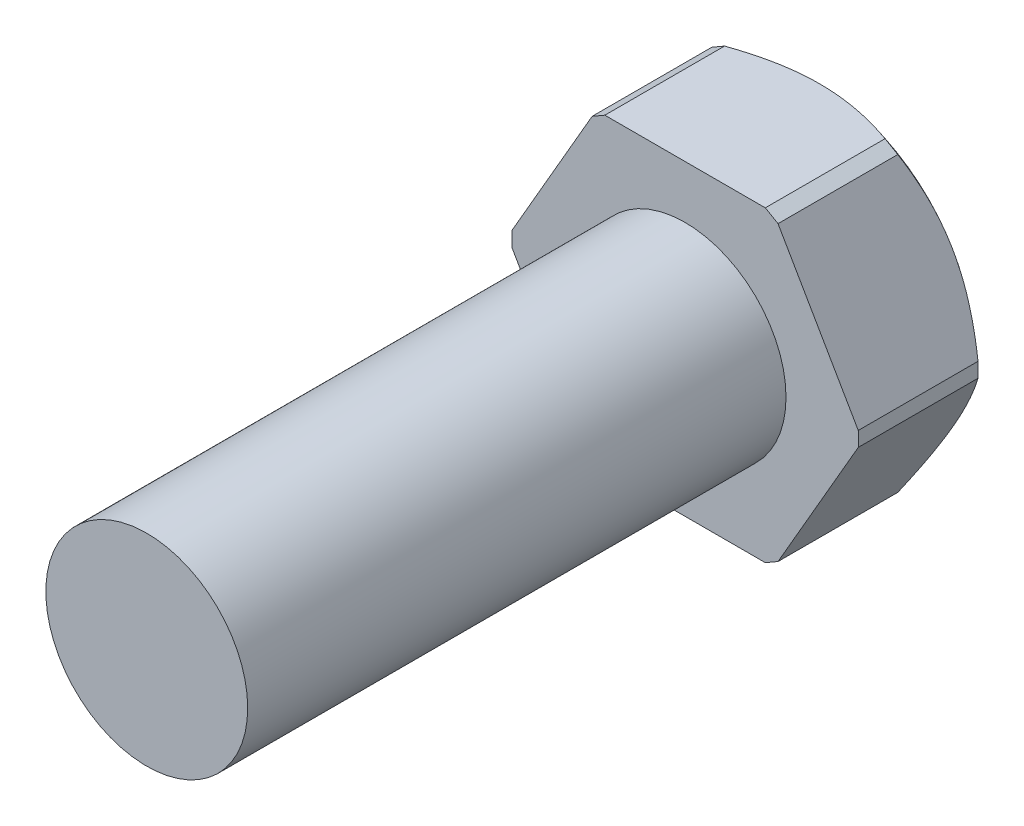
ISO-10303-21;
HEADER;
FILE_DESCRIPTION(('STEP AP214'),'2;1');
FILE_NAME('part.step','',(''),(''),'','','');
FILE_SCHEMA(('AUTOMOTIVE_DESIGN { 1 0 10303 214 1 1 1 1 }'));
ENDSEC;
DATA;
#1=APPLICATION_CONTEXT('core data for automotive mechanical design processes');
#2=APPLICATION_PROTOCOL_DEFINITION('international standard','automotive_design',2000,#1);
#3=PRODUCT_CONTEXT('',#1,'mechanical');
#4=PRODUCT('Part','Part','',(#3));
#5=PRODUCT_RELATED_PRODUCT_CATEGORY('part','',(#4));
#6=PRODUCT_DEFINITION_FORMATION('','',#4);
#7=PRODUCT_DEFINITION_CONTEXT('part definition',#1,'design');
#8=PRODUCT_DEFINITION('design','',#6,#7);
#9=PRODUCT_DEFINITION_SHAPE('','',#8);
#10=(LENGTH_UNIT() NAMED_UNIT(*) SI_UNIT(.MILLI.,.METRE.));
#11=(NAMED_UNIT(*) PLANE_ANGLE_UNIT() SI_UNIT($,.RADIAN.));
#12=(NAMED_UNIT(*) SI_UNIT($,.STERADIAN.) SOLID_ANGLE_UNIT());
#13=UNCERTAINTY_MEASURE_WITH_UNIT(LENGTH_MEASURE(1.E-05),#10,'distance_accuracy_value','');
#14=(GEOMETRIC_REPRESENTATION_CONTEXT(3) GLOBAL_UNCERTAINTY_ASSIGNED_CONTEXT((#13)) GLOBAL_UNIT_ASSIGNED_CONTEXT((#10,
#11,#12)) REPRESENTATION_CONTEXT('',''));
#15=CARTESIAN_POINT('',(0.,0.,0.));
#16=DIRECTION('',(0.,0.,1.));
#17=DIRECTION('',(1.,0.,0.));
#18=AXIS2_PLACEMENT_3D('',#15,#16,#17);
#19=CARTESIAN_POINT('',(4.18578945162487,-7.24999999999994,6.35));
#20=DIRECTION('',(-0.866025403784442,0.499999999999995,0.));
#21=DIRECTION('',(-0.499999999999995,-0.866025403784442,0.));
#22=AXIS2_PLACEMENT_3D('',#19,#20,#21);
#23=PLANE('',#22);
#24=DIRECTION('',(0.499999999999995,0.866025403784442,0.));
#25=VECTOR('',#24,1.);
#26=CARTESIAN_POINT('',(4.18578945162487,-7.24999999999994,6.35));
#27=LINE('',#26,#25);
#28=CARTESIAN_POINT('',(4.38578945162487,-6.90358983848616,6.35));
#29=VERTEX_POINT('',#28);
#30=CARTESIAN_POINT('',(8.17157890324957,-0.346410161513772,6.35));
#31=VERTEX_POINT('',#30);
#32=EDGE_CURVE('E265',#29,#31,#27,.T.);
#33=ORIENTED_EDGE('',*,*,#32,.F.);
#34=DIRECTION('',(0.,0.,-1.));
#35=VECTOR('',#34,1.);
#36=CARTESIAN_POINT('',(4.38578945162487,-6.90358983848616,6.35));
#37=LINE('',#36,#35);
#38=CARTESIAN_POINT('',(4.38578945162487,-6.90358983848616,0.699990018835444));
#39=VERTEX_POINT('',#38);
#40=EDGE_CURVE('E349',#29,#39,#37,.T.);
#41=ORIENTED_EDGE('',*,*,#40,.T.);
#42=CARTESIAN_POINT('',(8.3716943733034,0.000200000000000181,0.845257339780545));
#43=CARTESIAN_POINT('',(8.21794736422977,-0.266097631227295,0.729447113338614));
#44=CARTESIAN_POINT('',(8.06249149877793,-0.535355088524471,0.621816454666651));
#45=CARTESIAN_POINT('',(7.74782537875445,-1.08037279582571,0.427629359609718));
#46=CARTESIAN_POINT('',(7.58860502209093,-1.35615054316616,0.341138956178803));
#47=CARTESIAN_POINT('',(7.26857294470301,-1.91046236125387,0.195429584101643));
#48=CARTESIAN_POINT('',(7.10779134181242,-2.18894426638273,0.135955861824631));
#49=CARTESIAN_POINT('',(6.8651730026981,-2.60917155657672,0.0697386262103247));
#50=CARTESIAN_POINT('',(6.7840952919261,-2.7496022709952,0.0515014191885122));
#51=CARTESIAN_POINT('',(6.6215924413875,-3.03106546450283,0.0230431901224058));
#52=CARTESIAN_POINT('',(6.54016735003219,-3.17209785974117,0.0128210855588964));
#53=CARTESIAN_POINT('',(6.37601446521588,-3.45641899645203,0.000552368155458375));
#54=CARTESIAN_POINT('',(6.29328447830011,-3.59971153709965,-0.00137705293878134));
#55=CARTESIAN_POINT('',(6.1278848349123,-3.88619212300111,0.0033049604391076));
#56=CARTESIAN_POINT('',(6.04521517887639,-4.02938016749955,0.00991645605377523));
#57=CARTESIAN_POINT('',(5.88011192479759,-4.315347392059,0.0315258990519123));
#58=CARTESIAN_POINT('',(5.79767845736022,-4.45812634590459,0.0465278238628953));
#59=CARTESIAN_POINT('',(5.63327232170339,-4.74288612593828,0.0845646529897286));
#60=CARTESIAN_POINT('',(5.55129971667788,-4.88486684267124,0.107600632901399));
#61=CARTESIAN_POINT('',(5.30639050250552,-5.30906204485956,0.18801450070767));
#62=CARTESIAN_POINT('',(5.14436514369604,-5.58969819843215,0.256712062155177));
#63=CARTESIAN_POINT('',(4.82363026243174,-6.14522730854149,0.419269973294307));
#64=CARTESIAN_POINT('',(4.66491990157233,-6.42012171723759,0.513123875492929));
#65=CARTESIAN_POINT('',(4.45375692988558,-6.78586671287627,0.652811200701552));
#66=CARTESIAN_POINT('',(4.39980391337944,-6.87931607868651,0.689826685749797));
#67=CARTESIAN_POINT('',(4.29239695639809,-7.06535038526458,0.765981376798814));
#68=CARTESIAN_POINT('',(4.23894222460691,-7.15793669663187,0.805116114830897));
#69=CARTESIAN_POINT('',(4.18567398157103,-7.25019999999995,0.845257339780545));
#70=B_SPLINE_CURVE_WITH_KNOTS('',3,(#42,#43,#44,#45,#46,#47,#48,#49,#50,#51,#52,#53,#54,#55,#56,
#57,#58,#59,#60,#61,#62,#63,#64,#65,#66,#67,#68,#69),.UNSPECIFIED.,.F.,.F.,(4,2,2,2,2,2,2,2,2,2,
2,2,2,4),(0.,0.986085964652039,1.97521376105338,2.95481044041136,3.4441775332449,
3.93347852080068,4.42967200709298,4.92586904554469,5.42230150253419,5.91880044721531,
6.91121518526796,7.90337581327613,8.24559600631945,8.58712084857781),.UNSPECIFIED.);
#71=CARTESIAN_POINT('',(6.27868417743719,-3.62499999999996,0.));
#72=VERTEX_POINT('',#71);
#73=EDGE_CURVE('E177',#72,#39,#70,.T.);
#74=ORIENTED_EDGE('',*,*,#73,.F.);
#75=CARTESIAN_POINT('',(8.17157890323818,-0.346410161533495,0.699990018827494));
#76=VERTEX_POINT('',#75);
#77=EDGE_CURVE('E171',#76,#72,#70,.T.);
#78=ORIENTED_EDGE('',*,*,#77,.F.);
#79=DIRECTION('',(0.,0.,1.));
#80=VECTOR('',#79,1.);
#81=CARTESIAN_POINT('',(8.17157890324957,-0.346410161513772,6.35));
#82=LINE('',#81,#80);
#83=EDGE_CURVE('E51',#76,#31,#82,.T.);
#84=ORIENTED_EDGE('',*,*,#83,.T.);
#85=EDGE_LOOP('',(#33,#41,#74,#78,#84));
#86=FACE_BOUND('',#85,.T.);
#87=ADVANCED_FACE('F32',(#86),#23,.F.);
#88=CARTESIAN_POINT('',(8.37157890324957,0.,6.35));
#89=DIRECTION('',(-0.866025403784438,-0.500000000000001,0.));
#90=DIRECTION('',(0.500000000000001,-0.866025403784438,0.));
#91=AXIS2_PLACEMENT_3D('',#88,#89,#90);
#92=PLANE('',#91);
#93=DIRECTION('',(-0.500000000000001,0.866025403784438,0.));
#94=VECTOR('',#93,1.);
#95=CARTESIAN_POINT('',(8.37157890324957,0.,6.35));
#96=LINE('',#95,#94);
#97=CARTESIAN_POINT('',(8.17157890324956,0.346410161513784,6.35));
#98=VERTEX_POINT('',#97);
#99=CARTESIAN_POINT('',(4.38578945162477,6.90358983848623,6.35));
#100=VERTEX_POINT('',#99);
#101=EDGE_CURVE('E255',#98,#100,#96,.T.);
#102=ORIENTED_EDGE('',*,*,#101,.F.);
#103=DIRECTION('',(0.,0.,-1.));
#104=VECTOR('',#103,1.);
#105=CARTESIAN_POINT('',(8.17157890324956,0.346410161513784,6.35));
#106=LINE('',#105,#104);
#107=CARTESIAN_POINT('',(8.17157890324956,0.346410161531035,0.699990018835983));
#108=VERTEX_POINT('',#107);
#109=EDGE_CURVE('E257',#98,#108,#106,.T.);
#110=ORIENTED_EDGE('',*,*,#109,.T.);
#111=CARTESIAN_POINT('',(4.18567398157093,7.2502,0.845257339780545));
#112=CARTESIAN_POINT('',(4.33942099064457,6.98390236877271,0.729447113338614));
#113=CARTESIAN_POINT('',(4.49487685609641,6.71464491147553,0.621816454666651));
#114=CARTESIAN_POINT('',(4.80954297611989,6.16962720417429,0.427629359609714));
#115=CARTESIAN_POINT('',(4.96876333278341,5.89384945683384,0.341138956178796));
#116=CARTESIAN_POINT('',(5.28879541017133,5.33953763874614,0.195429584101633));
#117=CARTESIAN_POINT('',(5.44957701306192,5.06105573361728,0.135955861824619));
#118=CARTESIAN_POINT('',(5.69219535217625,4.64082844342329,0.0697386262103092));
#119=CARTESIAN_POINT('',(5.77327306294825,4.50039772900481,0.0515014191884955));
#120=CARTESIAN_POINT('',(5.93577591348685,4.21893453549718,0.0230431901223872));
#121=CARTESIAN_POINT('',(6.01720100484217,4.07790214025884,0.012821085558877));
#122=CARTESIAN_POINT('',(6.18135388965848,3.79358100354798,0.000552368155437234));
#123=CARTESIAN_POINT('',(6.26408387657425,3.65028846290037,-0.00137705293880349));
#124=CARTESIAN_POINT('',(6.42948351996206,3.3638078769989,0.00330496043908367));
#125=CARTESIAN_POINT('',(6.51215317599797,3.22061983250046,0.00991645605375058));
#126=CARTESIAN_POINT('',(6.67725643007677,2.93465260794102,0.031525899051886));
#127=CARTESIAN_POINT('',(6.75968989751414,2.79187365409542,0.0465278238628679));
#128=CARTESIAN_POINT('',(6.92409603317097,2.50711387406174,0.0845646529897001));
#129=CARTESIAN_POINT('',(7.00606863819648,2.36513315732878,0.10760063290137));
#130=CARTESIAN_POINT('',(7.25097785236885,1.94093795514046,0.18801450070764));
#131=CARTESIAN_POINT('',(7.41300321117833,1.66030180156787,0.256712062155146));
#132=CARTESIAN_POINT('',(7.73373809244264,1.10477269145853,0.419269973294274));
#133=CARTESIAN_POINT('',(7.89244845330205,0.829878282762435,0.513123875492894));
#134=CARTESIAN_POINT('',(8.10361142498881,0.464133287123737,0.652811200701523));
#135=CARTESIAN_POINT('',(8.15756444149496,0.370683921313491,0.689826685749774));
#136=CARTESIAN_POINT('',(8.26497139847633,0.184649614735391,0.765981376798802));
#137=CARTESIAN_POINT('',(8.31842613026751,0.0920633033680921,0.80511611483089));
#138=CARTESIAN_POINT('',(8.3716943733034,-0.00020000000000021,0.845257339780543));
#139=B_SPLINE_CURVE_WITH_KNOTS('',3,(#111,#112,#113,#114,#115,#116,#117,#118,#119,#120,#121,
#122,#123,#124,#125,#126,#127,#128,#129,#130,#131,#132,#133,#134,#135,#136,#137,#138),
.UNSPECIFIED.,.F.,.F.,(4,2,2,2,2,2,2,2,2,2,2,2,2,4),(0.,0.98608596465204,1.97521376105338,
2.95481044041137,3.4441775332449,3.93347852080068,4.42967200709298,4.92586904554469,
5.4223015025342,5.91880044721532,6.91121518526797,7.90337581327614,8.24559600631951,
8.58712084857791),.UNSPECIFIED.);
#140=CARTESIAN_POINT('',(6.27868417743717,3.625,0.));
#141=VERTEX_POINT('',#140);
#142=EDGE_CURVE('E174',#141,#108,#139,.T.);
#143=ORIENTED_EDGE('',*,*,#142,.F.);
#144=CARTESIAN_POINT('',(4.38578945161393,6.903589838505,0.699990018842994));
#145=VERTEX_POINT('',#144);
#146=EDGE_CURVE('E236',#145,#141,#139,.T.);
#147=ORIENTED_EDGE('',*,*,#146,.F.);
#148=DIRECTION('',(0.,0.,1.));
#149=VECTOR('',#148,1.);
#150=CARTESIAN_POINT('',(4.38578945162477,6.90358983848623,6.35));
#151=LINE('',#150,#149);
#152=EDGE_CURVE('E259',#145,#100,#151,.T.);
#153=ORIENTED_EDGE('',*,*,#152,.T.);
#154=EDGE_LOOP('',(#102,#110,#143,#147,#153));
#155=FACE_BOUND('',#154,.T.);
#156=ADVANCED_FACE('F242',(#155),#92,.F.);
#157=CARTESIAN_POINT('',(4.18578945162477,7.25,6.35));
#158=DIRECTION('',(0.,-1.,0.));
#159=DIRECTION('',(1.,0.,0.));
#160=AXIS2_PLACEMENT_3D('',#157,#158,#159);
#161=PLANE('',#160);
#162=CARTESIAN_POINT('',(-10.6847639089387,7.24999999999995,4.26682541853558));
#163=CARTESIAN_POINT('',(-10.4058342903041,7.24999999999995,4.09293868660948));
#164=CARTESIAN_POINT('',(-10.1259666405504,7.24999999999995,3.92053321528114));
#165=CARTESIAN_POINT('',(-9.56389585771816,7.24999999999996,3.57945890563532));
#166=CARTESIAN_POINT('',(-9.28169230650349,7.24999999999996,3.41079075709113));
#167=CARTESIAN_POINT('',(-8.71274479278106,7.24999999999996,3.07694548747804));
#168=CARTESIAN_POINT('',(-8.42598322769865,7.24999999999996,2.91179826953349));
#169=CARTESIAN_POINT('',(-7.84922003258186,7.24999999999996,2.58728375690707));
#170=CARTESIAN_POINT('',(-7.55921858661724,7.24999999999996,2.42791613602707));
#171=CARTESIAN_POINT('',(-6.95895395175072,7.24999999999996,2.10768593223505));
#172=CARTESIAN_POINT('',(-6.64846677713691,7.24999999999997,1.94724104881502));
#173=CARTESIAN_POINT('',(-6.02225190918354,7.24999999999997,1.63673198427579));
#174=CARTESIAN_POINT('',(-5.70652343878755,7.24999999999997,1.48666935974821));
#175=CARTESIAN_POINT('',(-5.06970350025846,7.24999999999997,1.20043578372125));
#176=CARTESIAN_POINT('',(-4.74862701615894,7.24999999999997,1.06423179450785));
#177=CARTESIAN_POINT('',(-4.09960036600907,7.24999999999997,0.809479142278499));
#178=CARTESIAN_POINT('',(-3.77165304463745,7.24999999999998,0.690923331096657));
#179=CARTESIAN_POINT('',(-3.11044055163145,7.24999999999998,0.477336816161141));
#180=CARTESIAN_POINT('',(-2.77722408514798,7.24999999999998,0.3821575588092));
#181=CARTESIAN_POINT('',(-2.10377586214331,7.24999999999998,0.22029560588987));
#182=CARTESIAN_POINT('',(-1.76354553033887,7.24999999999998,0.153607181657098));
#183=CARTESIAN_POINT('',(-1.25285491231957,7.24999999999998,0.0795740825210798));
#184=CARTESIAN_POINT('',(-1.08421688778832,7.24999999999998,0.0593054137040099));
#185=CARTESIAN_POINT('',(-0.746111800715356,7.24999999999999,0.0274017198550811));
#186=CARTESIAN_POINT('',(-0.576644745661931,7.24999999999999,0.0157666169842682));
#187=CARTESIAN_POINT('',(-0.237338915332661,7.24999999999999,0.00143645607701562));
#188=CARTESIAN_POINT('',(-0.0675001603468888,7.24999999999999,-0.00125907833781638));
#189=CARTESIAN_POINT('',(0.272066900403488,7.24999999999999,0.00234641709008832));
#190=CARTESIAN_POINT('',(0.441795208193102,7.24999999999999,0.00864727705552668));
#191=CARTESIAN_POINT('',(0.915578550970808,7.24999999999999,0.0386627614498811));
#192=CARTESIAN_POINT('',(1.21905364053156,7.24999999999999,0.0722443208552657));
#193=CARTESIAN_POINT('',(1.82185629339235,7.24999999999999,0.165453482796035));
#194=CARTESIAN_POINT('',(2.12118355454563,7.24999999999999,0.225082972598195));
#195=CARTESIAN_POINT('',(2.72075325266385,7.25,0.368011991906893));
#196=CARTESIAN_POINT('',(3.02088151691658,7.25,0.451784807573575));
#197=CARTESIAN_POINT('',(3.46652823794226,7.25,0.591532450759704));
#198=CARTESIAN_POINT('',(3.61431901571588,7.25,0.64046286969296));
#199=CARTESIAN_POINT('',(3.90843801935924,7.25,0.742531356783076));
#200=CARTESIAN_POINT('',(4.05476629267976,7.25,0.795669287925362));
#201=CARTESIAN_POINT('',(4.47687128268924,7.25,0.955119512663977));
#202=CARTESIAN_POINT('',(4.75080995568425,7.25,1.06630542492929));
#203=CARTESIAN_POINT('',(5.29409492801296,7.25000000000001,1.29943808232715));
#204=CARTESIAN_POINT('',(5.56344011659735,7.25000000000001,1.42138738733525));
#205=CARTESIAN_POINT('',(6.09830168439641,7.25000000000001,1.67398096576204));
#206=CARTESIAN_POINT('',(6.36381437244548,7.25000000000001,1.80463301903033));
#207=CARTESIAN_POINT('',(6.89129648005892,7.25000000000001,2.07282333149083));
#208=CARTESIAN_POINT('',(7.15326617018193,7.25000000000001,2.21036106104852));
#209=CARTESIAN_POINT('',(7.6753748726342,7.25000000000001,2.49165261220137));
#210=CARTESIAN_POINT('',(7.9355001462514,7.25000000000002,2.63543185279164));
#211=CARTESIAN_POINT('',(8.45315730665032,7.25000000000002,2.9275825518499));
#212=CARTESIAN_POINT('',(8.7106891533652,7.25000000000002,3.07595408112209));
#213=CARTESIAN_POINT('',(9.22340940098689,7.25000000000002,3.37640123436414));
#214=CARTESIAN_POINT('',(9.47859888703216,7.25000000000002,3.52847501012708));
#215=CARTESIAN_POINT('',(9.98708169993694,7.25000000000002,3.83576333617739));
#216=CARTESIAN_POINT('',(10.2403749967835,7.25000000000002,3.99097793603451));
#217=CARTESIAN_POINT('',(10.9454357504819,7.25000000000003,4.42807811589153));
#218=CARTESIAN_POINT('',(11.3954053847762,7.25000000000003,4.71286332880035));
#219=CARTESIAN_POINT('',(12.2913748428156,7.25000000000003,5.28870723893591));
#220=CARTESIAN_POINT('',(12.7373741628588,7.25000000000003,5.57976671657414));
#221=CARTESIAN_POINT('',(13.621887140777,7.25000000000003,6.16378987641532));
#222=CARTESIAN_POINT('',(14.0604313818487,7.25000000000004,6.45670729753581));
#223=CARTESIAN_POINT('',(14.716357026923,7.25000000000004,6.89879023441533));
#224=CARTESIAN_POINT('',(14.9346627343358,7.25000000000004,7.04658789996285));
#225=CARTESIAN_POINT('',(15.3707181145659,7.25000000000004,7.3429986590435));
#226=CARTESIAN_POINT('',(15.5884677905661,7.25000000000004,7.49161174789377));
#227=CARTESIAN_POINT('',(15.8059706274755,7.25000000000004,7.64058539646273));
#228=B_SPLINE_CURVE_WITH_KNOTS('',3,(#162,#163,#164,#165,#166,#167,#168,#169,#170,#171,#172,
#173,#174,#175,#176,#177,#178,#179,#180,#181,#182,#183,#184,#185,#186,#187,#188,#189,#190,#191,
#192,#193,#194,#195,#196,#197,#198,#199,#200,#201,#202,#203,#204,#205,#206,#207,#208,#209,#210,
#211,#212,#213,#214,#215,#216,#217,#218,#219,#220,#221,#222,#223,#224,#225,#226,#227),
.UNSPECIFIED.,.F.,.F.,(4,2,2,2,2,2,2,2,2,2,2,2,2,2,2,2,2,2,2,2,2,2,2,2,2,2,2,2,2,2,2,2,4),(0.,
0.986089321491635,1.97235914813305,2.96505450931675,3.95769375570518,5.00602027534745,
6.05450362943896,7.10042585997613,8.14592329378584,9.18459410635269,10.2230559744799,
10.7324237334901,11.2417869000602,11.7511229228698,12.2604493281059,13.1750549979202,
14.0897269452175,15.0237155928998,15.4907066005566,15.9576824072402,16.8442930737601,
17.7311151755132,18.6187409796911,19.5062986137833,20.3978916231487,21.2894983860061,
22.1806688228826,23.0718533355556,24.6693286002024,26.2670037232967,27.8490959824957,
28.6399889057095,29.4308772916757),.UNSPECIFIED.);
#229=CARTESIAN_POINT('',(-3.78578945161244,7.24999999999998,0.699990018831121));
#230=VERTEX_POINT('',#229);
#231=CARTESIAN_POINT('',(0.,7.24999999999999,0.));
#232=VERTEX_POINT('',#231);
#233=EDGE_CURVE('E382',#230,#232,#228,.T.);
#234=ORIENTED_EDGE('',*,*,#233,.F.);
#235=DIRECTION('',(0.,0.,1.));
#236=VECTOR('',#235,1.);
#237=CARTESIAN_POINT('',(-3.78578945162482,7.24999999999998,6.35));
#238=LINE('',#237,#236);
#239=CARTESIAN_POINT('',(-3.78578945162482,7.24999999999998,6.35));
#240=VERTEX_POINT('',#239);
#241=EDGE_CURVE('E361',#230,#240,#238,.T.);
#242=ORIENTED_EDGE('',*,*,#241,.T.);
#243=DIRECTION('',(-1.,0.,0.));
#244=VECTOR('',#243,1.);
#245=CARTESIAN_POINT('',(4.18578945162477,7.25,6.35));
#246=LINE('',#245,#244);
#247=CARTESIAN_POINT('',(3.78578945162477,7.25,6.35));
#248=VERTEX_POINT('',#247);
#249=EDGE_CURVE('E264',#248,#240,#246,.T.);
#250=ORIENTED_EDGE('',*,*,#249,.F.);
#251=DIRECTION('',(0.,0.,-1.));
#252=VECTOR('',#251,1.);
#253=CARTESIAN_POINT('',(3.78578945162477,7.25,6.35));
#254=LINE('',#253,#252);
#255=CARTESIAN_POINT('',(3.78578945162477,7.25,0.699990018835444));
#256=VERTEX_POINT('',#255);
#257=EDGE_CURVE('E366',#248,#256,#254,.T.);
#258=ORIENTED_EDGE('',*,*,#257,.T.);
#259=EDGE_CURVE('E237',#232,#256,#228,.T.);
#260=ORIENTED_EDGE('',*,*,#259,.F.);
#261=EDGE_LOOP('',(#234,#242,#250,#258,#260));
#262=FACE_BOUND('',#261,.T.);
#263=ADVANCED_FACE('F221',(#262),#161,.F.);
#264=CARTESIAN_POINT('',(-4.18578945162482,7.24999999999997,6.35));
#265=DIRECTION('',(0.866025403784442,-0.499999999999995,0.));
#266=DIRECTION('',(0.499999999999995,0.866025403784442,0.));
#267=AXIS2_PLACEMENT_3D('',#264,#265,#266);
#268=PLANE('',#267);
#269=CARTESIAN_POINT('',(-8.3716943733034,-0.000200000000058277,0.845257339780545));
#270=CARTESIAN_POINT('',(-8.21794736422977,0.266097631227237,0.729447113338613));
#271=CARTESIAN_POINT('',(-8.06249149877793,0.535355088524413,0.62181645466665));
#272=CARTESIAN_POINT('',(-7.74782537875445,1.08037279582565,0.427629359609713));
#273=CARTESIAN_POINT('',(-7.58860502209093,1.3561505431661,0.341138956178796));
#274=CARTESIAN_POINT('',(-7.26857294470301,1.91046236125381,0.195429584101633));
#275=CARTESIAN_POINT('',(-7.10779134181242,2.18894426638267,0.135955861824619));
#276=CARTESIAN_POINT('',(-6.8651730026981,2.60917155657666,0.0697386262103098));
#277=CARTESIAN_POINT('',(-6.7840952919261,2.74960227099514,0.0515014191884963));
#278=CARTESIAN_POINT('',(-6.6215924413875,3.03106546450277,0.0230431901223877));
#279=CARTESIAN_POINT('',(-6.54016735003219,3.17209785974111,0.0128210855588769));
#280=CARTESIAN_POINT('',(-6.37601446521587,3.45641899645197,0.000552368155436736));
#281=CARTESIAN_POINT('',(-6.29328447830011,3.59971153709959,-0.00137705293880359));
#282=CARTESIAN_POINT('',(-6.1278848349123,3.88619212300106,0.00330496043908376));
#283=CARTESIAN_POINT('',(-6.04521517887639,4.02938016749949,0.00991645605375038));
#284=CARTESIAN_POINT('',(-5.88011192479759,4.31534739205894,0.0315258990518855));
#285=CARTESIAN_POINT('',(-5.79767845736022,4.45812634590454,0.0465278238628675));
#286=CARTESIAN_POINT('',(-5.63327232170339,4.74288612593822,0.0845646529896997));
#287=CARTESIAN_POINT('',(-5.55129971667788,4.88486684267118,0.10760063290137));
#288=CARTESIAN_POINT('',(-5.30639050250552,5.3090620448595,0.188014500707639));
#289=CARTESIAN_POINT('',(-5.14436514369604,5.5896981984321,0.256712062155146));
#290=CARTESIAN_POINT('',(-4.82363026243174,6.14522730854144,0.419269973294273));
#291=CARTESIAN_POINT('',(-4.66491990157233,6.42012171723753,0.513123875492893));
#292=CARTESIAN_POINT('',(-4.45375692988557,6.78586671287623,0.652811200701522));
#293=CARTESIAN_POINT('',(-4.39980391337942,6.87931607868648,0.689826685749773));
#294=CARTESIAN_POINT('',(-4.29239695639805,7.06535038526458,0.765981376798802));
#295=CARTESIAN_POINT('',(-4.23894222460687,7.15793669663188,0.80511611483089));
#296=CARTESIAN_POINT('',(-4.18567398157098,7.25019999999997,0.845257339780544));
#297=B_SPLINE_CURVE_WITH_KNOTS('',3,(#269,#270,#271,#272,#273,#274,#275,#276,#277,#278,#279,
#280,#281,#282,#283,#284,#285,#286,#287,#288,#289,#290,#291,#292,#293,#294,#295,#296),
.UNSPECIFIED.,.F.,.F.,(4,2,2,2,2,2,2,2,2,2,2,2,2,4),(0.,0.98608596465204,1.97521376105338,
2.95481044041137,3.4441775332449,3.93347852080068,4.42967200709298,4.9258690455447,
5.4223015025342,5.91880044721532,6.91121518526796,7.90337581327614,8.24559600631951,
8.58712084857792),.UNSPECIFIED.);
#298=CARTESIAN_POINT('',(-8.17157890324957,0.346410161513705,0.699990018835439));
#299=VERTEX_POINT('',#298);
#300=CARTESIAN_POINT('',(-6.27868417743719,3.62499999999996,0.));
#301=VERTEX_POINT('',#300);
#302=EDGE_CURVE('E170',#299,#301,#297,.T.);
#303=ORIENTED_EDGE('',*,*,#302,.F.);
#304=DIRECTION('',(0.,0.,1.));
#305=VECTOR('',#304,1.);
#306=CARTESIAN_POINT('',(-8.17157890324957,0.346410161513716,6.35));
#307=LINE('',#306,#305);
#308=CARTESIAN_POINT('',(-8.17157890324957,0.346410161513716,6.35));
#309=VERTEX_POINT('',#308);
#310=EDGE_CURVE('E148',#299,#309,#307,.T.);
#311=ORIENTED_EDGE('',*,*,#310,.T.);
#312=DIRECTION('',(-0.499999999999995,-0.866025403784441,0.));
#313=VECTOR('',#312,1.);
#314=CARTESIAN_POINT('',(-4.18578945162482,7.24999999999997,6.35));
#315=LINE('',#314,#313);
#316=CARTESIAN_POINT('',(-4.38578945162481,6.9035898384862,6.35));
#317=VERTEX_POINT('',#316);
#318=EDGE_CURVE('E268',#317,#309,#315,.T.);
#319=ORIENTED_EDGE('',*,*,#318,.F.);
#320=DIRECTION('',(0.,0.,-1.));
#321=VECTOR('',#320,1.);
#322=CARTESIAN_POINT('',(-4.38578945162481,6.9035898384862,6.35));
#323=LINE('',#322,#321);
#324=CARTESIAN_POINT('',(-4.38578945162481,6.9035898384862,0.699990018835444));
#325=VERTEX_POINT('',#324);
#326=EDGE_CURVE('E358',#317,#325,#323,.T.);
#327=ORIENTED_EDGE('',*,*,#326,.T.);
#328=EDGE_CURVE('E176',#301,#325,#297,.T.);
#329=ORIENTED_EDGE('',*,*,#328,.F.);
#330=EDGE_LOOP('',(#303,#311,#319,#327,#329));
#331=FACE_BOUND('',#330,.T.);
#332=ADVANCED_FACE('F217',(#331),#268,.F.);
#333=CARTESIAN_POINT('',(-8.37157890324957,0.,6.35));
#334=DIRECTION('',(0.866025403784435,0.500000000000007,0.));
#335=DIRECTION('',(-0.500000000000007,0.866025403784435,0.));
#336=AXIS2_PLACEMENT_3D('',#333,#334,#335);
#337=PLANE('',#336);
#338=DIRECTION('',(0.500000000000007,-0.866025403784435,0.));
#339=VECTOR('',#338,1.);
#340=CARTESIAN_POINT('',(-8.37157890324957,0.,6.35));
#341=LINE('',#340,#339);
#342=CARTESIAN_POINT('',(-8.17157890324956,-0.346410161513829,6.35));
#343=VERTEX_POINT('',#342);
#344=CARTESIAN_POINT('',(-4.38578945162472,-6.90358983848625,6.35));
#345=VERTEX_POINT('',#344);
#346=EDGE_CURVE('E163',#343,#345,#341,.T.);
#347=ORIENTED_EDGE('',*,*,#346,.F.);
#348=DIRECTION('',(0.,0.,-1.));
#349=VECTOR('',#348,1.);
#350=CARTESIAN_POINT('',(-8.17157890324956,-0.346410161513829,6.35));
#351=LINE('',#350,#349);
#352=CARTESIAN_POINT('',(-8.17157890324956,-0.346410161528074,0.6999900188359));
#353=VERTEX_POINT('',#352);
#354=EDGE_CURVE('E145',#343,#353,#351,.T.);
#355=ORIENTED_EDGE('',*,*,#354,.T.);
#356=CARTESIAN_POINT('',(-4.18567398157088,-7.25020000000003,0.845257339780545));
#357=CARTESIAN_POINT('',(-4.33942099064452,-6.98390236877274,0.729447113338613));
#358=CARTESIAN_POINT('',(-4.49487685609636,-6.71464491147556,0.621816454666649));
#359=CARTESIAN_POINT('',(-4.80954297611985,-6.16962720417433,0.427629359609712));
#360=CARTESIAN_POINT('',(-4.96876333278336,-5.89384945683388,0.341138956178796));
#361=CARTESIAN_POINT('',(-5.2887954101713,-5.33953763874618,0.195429584101632));
#362=CARTESIAN_POINT('',(-5.44957701306189,-5.06105573361731,0.135955861824618));
#363=CARTESIAN_POINT('',(-5.69219535217622,-4.64082844342333,0.0697386262103091));
#364=CARTESIAN_POINT('',(-5.77327306294822,-4.50039772900485,0.0515014191884958));
#365=CARTESIAN_POINT('',(-5.93577591348682,-4.21893453549722,0.0230431901223876));
#366=CARTESIAN_POINT('',(-6.01720100484214,-4.07790214025888,0.012821085558877));
#367=CARTESIAN_POINT('',(-6.18135388965846,-3.79358100354803,0.000552368155437178));
#368=CARTESIAN_POINT('',(-6.26408387657422,-3.65028846290041,-0.00137705293880322));
#369=CARTESIAN_POINT('',(-6.42948351996204,-3.36380787699895,0.00330496043908405));
#370=CARTESIAN_POINT('',(-6.51215317599795,-3.22061983250051,0.00991645605375071));
#371=CARTESIAN_POINT('',(-6.67725643007675,-2.93465260794107,0.0315258990518862));
#372=CARTESIAN_POINT('',(-6.75968989751413,-2.79187365409547,0.0465278238628684));
#373=CARTESIAN_POINT('',(-6.92409603317096,-2.50711387406178,0.0845646529897006));
#374=CARTESIAN_POINT('',(-7.00606863819647,-2.36513315732882,0.10760063290137));
#375=CARTESIAN_POINT('',(-7.25097785236884,-1.94093795514051,0.18801450070764));
#376=CARTESIAN_POINT('',(-7.41300321117832,-1.66030180156792,0.256712062155147));
#377=CARTESIAN_POINT('',(-7.73373809244263,-1.10477269145858,0.419269973294275));
#378=CARTESIAN_POINT('',(-7.89244845330204,-0.829878282762487,0.513123875492896));
#379=CARTESIAN_POINT('',(-8.10361142498881,-0.464133287123791,0.652811200701524));
#380=CARTESIAN_POINT('',(-8.15756444149496,-0.370683921313545,0.689826685749775));
#381=CARTESIAN_POINT('',(-8.26497139847633,-0.184649614735448,0.765981376798802));
#382=CARTESIAN_POINT('',(-8.31842613026751,-0.09206330336815,0.805116114830891));
#383=CARTESIAN_POINT('',(-8.3716943733034,0.000199999999942134,0.845257339780543));
#384=B_SPLINE_CURVE_WITH_KNOTS('',3,(#356,#357,#358,#359,#360,#361,#362,#363,#364,#365,#366,
#367,#368,#369,#370,#371,#372,#373,#374,#375,#376,#377,#378,#379,#380,#381,#382,#383),
.UNSPECIFIED.,.F.,.F.,(4,2,2,2,2,2,2,2,2,2,2,2,2,4),(0.,0.986085964652041,1.97521376105338,
2.95481044041137,3.4441775332449,3.93347852080068,4.42967200709298,4.9258690455447,
5.4223015025342,5.91880044721532,6.91121518526797,7.90337581327614,8.24559600631951,
8.58712084857791),.UNSPECIFIED.);
#385=CARTESIAN_POINT('',(-6.27868417743714,-3.62500000000004,0.));
#386=VERTEX_POINT('',#385);
#387=EDGE_CURVE('E160',#386,#353,#384,.T.);
#388=ORIENTED_EDGE('',*,*,#387,.F.);
#389=CARTESIAN_POINT('',(-4.38578945161388,-6.90358983850502,0.699990018842992));
#390=VERTEX_POINT('',#389);
#391=EDGE_CURVE('E173',#390,#386,#384,.T.);
#392=ORIENTED_EDGE('',*,*,#391,.F.);
#393=DIRECTION('',(0.,0.,1.));
#394=VECTOR('',#393,1.);
#395=CARTESIAN_POINT('',(-4.38578945162472,-6.90358983848625,6.35));
#396=LINE('',#395,#394);
#397=EDGE_CURVE('E334',#390,#345,#396,.T.);
#398=ORIENTED_EDGE('',*,*,#397,.T.);
#399=EDGE_LOOP('',(#347,#355,#388,#392,#398));
#400=FACE_BOUND('',#399,.T.);
#401=ADVANCED_FACE('F158',(#400),#337,.F.);
#402=CARTESIAN_POINT('',(-4.18578945162472,-7.25000000000003,6.35));
#403=DIRECTION('',(0.,1.,0.));
#404=DIRECTION('',(-1.,0.,0.));
#405=AXIS2_PLACEMENT_3D('',#402,#403,#404);
#406=PLANE('',#405);
#407=DIRECTION('',(1.,0.,0.));
#408=VECTOR('',#407,1.);
#409=CARTESIAN_POINT('',(-4.18578945162472,-7.25000000000003,6.35));
#410=LINE('',#409,#408);
#411=CARTESIAN_POINT('',(-3.78578945162472,-7.25000000000003,6.35));
#412=VERTEX_POINT('',#411);
#413=CARTESIAN_POINT('',(3.78578945162487,-7.24999999999995,6.35));
#414=VERTEX_POINT('',#413);
#415=EDGE_CURVE('E278',#412,#414,#410,.T.);
#416=ORIENTED_EDGE('',*,*,#415,.F.);
#417=DIRECTION('',(0.,0.,-1.));
#418=VECTOR('',#417,1.);
#419=CARTESIAN_POINT('',(-3.78578945162472,-7.25000000000003,6.35));
#420=LINE('',#419,#418);
#421=CARTESIAN_POINT('',(-3.78578945162472,-7.25000000000003,0.699990018835447));
#422=VERTEX_POINT('',#421);
#423=EDGE_CURVE('E336',#412,#422,#420,.T.);
#424=ORIENTED_EDGE('',*,*,#423,.T.);
#425=CARTESIAN_POINT('',(-10.6847638912717,-7.2500000000001,4.26682540751929));
#426=CARTESIAN_POINT('',(-10.4058342731977,-7.2500000000001,4.09293867603322));
#427=CARTESIAN_POINT('',(-10.1259666240052,-7.25000000000009,3.92053320514459));
#428=CARTESIAN_POINT('',(-9.56389584229806,-7.25000000000009,3.57945889637622));
#429=CARTESIAN_POINT('',(-9.28169229164729,-7.25000000000008,3.41079074826977));
#430=CARTESIAN_POINT('',(-8.71274477906691,-7.25000000000008,3.07694547953552));
#431=CARTESIAN_POINT('',(-8.42598321456275,-7.25000000000007,2.91179826203193));
#432=CARTESIAN_POINT('',(-7.84922002060819,-7.25000000000007,2.58728375028099));
#433=CARTESIAN_POINT('',(-7.55921857522755,-7.25000000000007,2.42791612983551));
#434=CARTESIAN_POINT('',(-6.95895394163238,-7.25000000000006,2.10768592695917));
#435=CARTESIAN_POINT('',(-6.64846676770729,-7.25000000000006,1.94724104401807));
#436=CARTESIAN_POINT('',(-6.02225190114801,-7.25000000000005,1.63673198041281));
#437=CARTESIAN_POINT('',(-5.7065234314574,-7.25000000000005,1.48666935634024));
#438=CARTESIAN_POINT('',(-5.06970349435552,-7.25000000000004,1.20043578118115));
#439=CARTESIAN_POINT('',(-4.74862701097769,-7.25000000000004,1.06423179238088));
#440=CARTESIAN_POINT('',(-4.09960036230021,-7.25000000000003,0.809479140915957));
#441=CARTESIAN_POINT('',(-3.77165304167925,-7.25000000000003,0.690923330085485));
#442=CARTESIAN_POINT('',(-3.11044054885479,-7.25000000000002,0.477336815319506));
#443=CARTESIAN_POINT('',(-2.77722408177174,-7.25000000000002,0.382157557878578));
#444=CARTESIAN_POINT('',(-2.10377585754877,-7.25000000000001,0.220295604904313));
#445=CARTESIAN_POINT('',(-1.76354552512565,-7.25000000000001,0.15360718070543));
#446=CARTESIAN_POINT('',(-1.25285490618429,-7.25,0.0795740817281058));
#447=CARTESIAN_POINT('',(-1.08421688134992,-7.25,0.0593054129807363));
#448=CARTESIAN_POINT('',(-0.74611179367325,-7.25,0.0274017193061935));
#449=CARTESIAN_POINT('',(-0.57664473831924,-7.24999999999999,0.0157666165400657));
#450=CARTESIAN_POINT('',(-0.237338907394226,-7.24999999999999,0.00143645587581821));
#451=CARTESIAN_POINT('',(-0.0675001521132947,-7.24999999999999,-0.00125907840068076));
#452=CARTESIAN_POINT('',(0.272066909219031,-7.24999999999998,0.00234641733418424));
#453=CARTESIAN_POINT('',(0.441795217295434,-7.24999999999998,0.0086472774682485));
#454=CARTESIAN_POINT('',(0.915578560541113,-7.24999999999998,0.0386627623494056));
#455=CARTESIAN_POINT('',(1.21905365027338,-7.24999999999998,0.072244322071276));
#456=CARTESIAN_POINT('',(1.82185630345167,-7.24999999999997,0.165453484642618));
#457=CARTESIAN_POINT('',(2.12118356475092,-7.24999999999997,0.225082974758842));
#458=CARTESIAN_POINT('',(2.72075326315639,-7.24999999999996,0.368011994686277));
#459=CARTESIAN_POINT('',(3.02088152754988,-7.24999999999996,0.451784810657912));
#460=CARTESIAN_POINT('',(3.46652824878064,-7.24999999999995,0.591532454283479));
#461=CARTESIAN_POINT('',(3.61431902662157,-7.24999999999995,0.640462873360209));
#462=CARTESIAN_POINT('',(3.90843803039826,-7.24999999999995,0.742531360731188));
#463=CARTESIAN_POINT('',(4.05476630378479,-7.24999999999995,0.795669292010863));
#464=CARTESIAN_POINT('',(4.47687129486161,-7.24999999999994,0.955119517470102));
#465=CARTESIAN_POINT('',(4.75080996884117,-7.24999999999994,1.06630543035351));
#466=CARTESIAN_POINT('',(5.29409494311285,-7.24999999999993,1.29943808902831));
#467=CARTESIAN_POINT('',(5.56344013265565,-7.24999999999993,1.42138739469527));
#468=CARTESIAN_POINT('',(6.09830170235366,-7.24999999999993,1.67398097446626));
#469=CARTESIAN_POINT('',(6.36381439134326,-7.24999999999992,1.80463302841993));
#470=CARTESIAN_POINT('',(6.89129650082375,-7.24999999999992,2.07282334226689));
#471=CARTESIAN_POINT('',(7.15326619187328,-7.24999999999991,2.21036107252565));
#472=CARTESIAN_POINT('',(7.67537489617326,-7.24999999999991,2.49165262509338));
#473=CARTESIAN_POINT('',(7.9355001707116,-7.24999999999991,2.63543186639752));
#474=CARTESIAN_POINT('',(8.45315733294617,-7.2499999999999,2.92758256688906));
#475=CARTESIAN_POINT('',(8.71068918057557,-7.2499999999999,3.07595409688066));
#476=CARTESIAN_POINT('',(9.22340943002099,-7.24999999999989,3.37640125156386));
#477=CARTESIAN_POINT('',(9.47859891697548,-7.24999999999989,3.52847502804854));
#478=CARTESIAN_POINT('',(9.98708173169575,-7.24999999999989,3.83576335554359));
#479=CARTESIAN_POINT('',(10.2403750294486,-7.24999999999988,3.99097795612372));
#480=CARTESIAN_POINT('',(10.9454357854504,-7.24999999999988,4.42807813786068));
#481=CARTESIAN_POINT('',(11.3954054211426,-7.24999999999987,4.71286335192249));
#482=CARTESIAN_POINT('',(12.2913748819795,-7.24999999999986,5.28870726435654));
#483=CARTESIAN_POINT('',(12.7373742034224,-7.24999999999986,5.57976674314027));
#484=CARTESIAN_POINT('',(13.6218871841334,-7.24999999999985,6.16378990525728));
#485=CARTESIAN_POINT('',(14.0604314265981,-7.24999999999984,6.4567073275082));
#486=CARTESIAN_POINT('',(14.7163570737638,-7.24999999999984,6.89879026607872));
#487=CARTESIAN_POINT('',(14.9346627818739,-7.24999999999983,7.04658793218907));
#488=CARTESIAN_POINT('',(15.3707181634994,-7.24999999999983,7.34299869239398));
#489=CARTESIAN_POINT('',(15.5884678401975,-7.24999999999983,7.49161178180567));
#490=CARTESIAN_POINT('',(15.8059706778052,-7.24999999999983,7.64058543093538));
#491=B_SPLINE_CURVE_WITH_KNOTS('',3,(#425,#426,#427,#428,#429,#430,#431,#432,#433,#434,#435,
#436,#437,#438,#439,#440,#441,#442,#443,#444,#445,#446,#447,#448,#449,#450,#451,#452,#453,#454,
#455,#456,#457,#458,#459,#460,#461,#462,#463,#464,#465,#466,#467,#468,#469,#470,#471,#472,#473,
#474,#475,#476,#477,#478,#479,#480,#481,#482,#483,#484,#485,#486,#487,#488,#489,#490),
.UNSPECIFIED.,.F.,.F.,(4,2,2,2,2,2,2,2,2,2,2,2,2,2,2,2,2,2,2,2,2,2,2,2,2,2,2,2,2,2,2,2,4),(0.,
0.986089319366278,1.97235914388184,2.96505450290209,3.95769374712737,5.00602026427475,
6.05450361586986,7.10042584393123,8.14592327526919,9.18459408963235,10.2230559595504,
10.7324237194374,11.2417868868842,11.7511229105712,12.2604493166848,13.1750549871146,
14.0897269350268,15.0237155833637,15.4907065913476,15.9576823983583,16.8442930683105,
17.7311151734976,18.6187409811148,19.5062986186455,20.3978916314656,21.2894983977777,
22.1806688381058,23.0718533542303,24.6693286242706,26.2670037527599,27.8490960173178,
28.6399889432106,29.4308773318558),.UNSPECIFIED.);
#492=CARTESIAN_POINT('',(0.,-7.24999999999999,0.));
#493=VERTEX_POINT('',#492);
#494=EDGE_CURVE('E189',#493,#422,#491,.F.);
#495=ORIENTED_EDGE('',*,*,#494,.F.);
#496=CARTESIAN_POINT('',(3.78578945161257,-7.24999999999995,0.699990018831141));
#497=VERTEX_POINT('',#496);
#498=EDGE_CURVE('E184',#497,#493,#491,.F.);
#499=ORIENTED_EDGE('',*,*,#498,.F.);
#500=DIRECTION('',(0.,0.,1.));
#501=VECTOR('',#500,1.);
#502=CARTESIAN_POINT('',(3.78578945162487,-7.24999999999995,6.35));
#503=LINE('',#502,#501);
#504=EDGE_CURVE('E59',#497,#414,#503,.T.);
#505=ORIENTED_EDGE('',*,*,#504,.T.);
#506=EDGE_LOOP('',(#416,#424,#495,#499,#505));
#507=FACE_BOUND('',#506,.T.);
#508=ADVANCED_FACE('F206',(#507),#406,.F.);
#509=CARTESIAN_POINT('',(0.,0.,6.35));
#510=DIRECTION('',(0.,0.,1.));
#511=DIRECTION('',(1.,0.,0.));
#512=AXIS2_PLACEMENT_3D('',#509,#510,#511);
#513=PLANE('',#512);
#514=DIRECTION('',(0.,1.,0.));
#515=VECTOR('',#514,1.);
#516=CARTESIAN_POINT('',(-8.17157890324957,0.,6.35));
#517=LINE('',#516,#515);
#518=EDGE_CURVE('E341',#343,#309,#517,.T.);
#519=ORIENTED_EDGE('',*,*,#518,.F.);
#520=ORIENTED_EDGE('',*,*,#346,.T.);
#521=DIRECTION('',(-0.866025403784439,0.499999999999999,0.));
#522=VECTOR('',#521,1.);
#523=CARTESIAN_POINT('',(-4.08578945162477,-7.07679491924311,6.35));
#524=LINE('',#523,#522);
#525=EDGE_CURVE('E333',#412,#345,#524,.T.);
#526=ORIENTED_EDGE('',*,*,#525,.F.);
#527=ORIENTED_EDGE('',*,*,#415,.T.);
#528=DIRECTION('',(-0.866025403784433,-0.50000000000001,0.));
#529=VECTOR('',#528,1.);
#530=CARTESIAN_POINT('',(4.08578945162486,-7.07679491924306,6.35));
#531=LINE('',#530,#529);
#532=EDGE_CURVE('E352',#29,#414,#531,.T.);
#533=ORIENTED_EDGE('',*,*,#532,.F.);
#534=ORIENTED_EDGE('',*,*,#32,.T.);
#535=DIRECTION('',(0.,-1.,0.));
#536=VECTOR('',#535,1.);
#537=CARTESIAN_POINT('',(8.17157890324956,1.09320914303443E-13,6.35));
#538=LINE('',#537,#536);
#539=EDGE_CURVE('E356',#98,#31,#538,.T.);
#540=ORIENTED_EDGE('',*,*,#539,.F.);
#541=ORIENTED_EDGE('',*,*,#101,.T.);
#542=DIRECTION('',(0.866025403784439,-0.499999999999999,0.));
#543=VECTOR('',#542,1.);
#544=CARTESIAN_POINT('',(4.08578945162477,7.07679491924311,6.35));
#545=LINE('',#544,#543);
#546=EDGE_CURVE('E369',#248,#100,#545,.T.);
#547=ORIENTED_EDGE('',*,*,#546,.F.);
#548=ORIENTED_EDGE('',*,*,#249,.T.);
#549=DIRECTION('',(0.866025403784437,0.500000000000004,0.));
#550=VECTOR('',#549,1.);
#551=CARTESIAN_POINT('',(-4.08578945162481,7.07679491924309,6.35));
#552=LINE('',#551,#550);
#553=EDGE_CURVE('E364',#317,#240,#552,.T.);
#554=ORIENTED_EDGE('',*,*,#553,.F.);
#555=ORIENTED_EDGE('',*,*,#318,.T.);
#556=EDGE_LOOP('',(#519,#520,#526,#527,#533,#534,#540,#541,#547,#548,#554,#555));
#557=FACE_BOUND('',#556,.T.);
#558=CARTESIAN_POINT('',(0.,0.,6.35));
#559=DIRECTION('',(0.,0.,1.));
#560=DIRECTION('',(1.,0.,0.));
#561=AXIS2_PLACEMENT_3D('',#558,#559,#560);
#562=CIRCLE('',#561,4.7625);
#563=CARTESIAN_POINT('',(4.7625,0.,6.35));
#564=VERTEX_POINT('',#563);
#565=EDGE_CURVE('E386',#564,#564,#562,.T.);
#566=ORIENTED_EDGE('',*,*,#565,.F.);
#567=EDGE_LOOP('',(#566));
#568=FACE_BOUND('',#567,.T.);
#569=ADVANCED_FACE('F210',(#557,#568),#513,.T.);
#570=CARTESIAN_POINT('',(0.,0.,31.75));
#571=DIRECTION('',(0.,0.,-1.));
#572=DIRECTION('',(-1.,0.,0.));
#573=AXIS2_PLACEMENT_3D('',#570,#571,#572);
#574=CYLINDRICAL_SURFACE('',#573,4.7625);
#575=CARTESIAN_POINT('',(0.,0.,31.75));
#576=DIRECTION('',(0.,0.,1.));
#577=DIRECTION('',(1.,0.,0.));
#578=AXIS2_PLACEMENT_3D('',#575,#576,#577);
#579=CIRCLE('',#578,4.7625);
#580=CARTESIAN_POINT('',(4.7625,0.,31.75));
#581=VERTEX_POINT('',#580);
#582=EDGE_CURVE('E271',#581,#581,#579,.T.);
#583=ORIENTED_EDGE('',*,*,#582,.F.);
#584=EDGE_LOOP('',(#583));
#585=FACE_BOUND('',#584,.T.);
#586=ORIENTED_EDGE('',*,*,#565,.T.);
#587=EDGE_LOOP('',(#586));
#588=FACE_BOUND('',#587,.T.);
#589=ADVANCED_FACE('F416',(#585,#588),#574,.T.);
#590=CARTESIAN_POINT('',(0.,0.,31.75));
#591=DIRECTION('',(0.,0.,1.));
#592=DIRECTION('',(1.,0.,0.));
#593=AXIS2_PLACEMENT_3D('',#590,#591,#592);
#594=PLANE('',#593);
#595=ORIENTED_EDGE('',*,*,#582,.T.);
#596=EDGE_LOOP('',(#595));
#597=FACE_BOUND('',#596,.T.);
#598=ADVANCED_FACE('F412',(#597),#594,.T.);
#599=CARTESIAN_POINT('',(0.,0.,0.));
#600=DIRECTION('',(0.,0.,1.));
#601=DIRECTION('',(-1.,0.,0.));
#602=AXIS2_PLACEMENT_3D('',#599,#600,#601);
#603=CONICAL_SURFACE('',#602,7.24999999999999,0.925024503556996);
#604=CARTESIAN_POINT('',(8.17157890324963,-4.75625641139662,1.66157280578314));
#605=CARTESIAN_POINT('',(8.17157890324962,-4.42944181346316,1.53773297088197));
#606=CARTESIAN_POINT('',(8.17157890324962,-4.09921627375302,1.42203963232824));
#607=CARTESIAN_POINT('',(8.17157890324961,-3.43124214386393,1.21135086505552));
#608=CARTESIAN_POINT('',(8.17157890324961,-3.09347483155612,1.11641522768384));
#609=CARTESIAN_POINT('',(8.1715789032496,-2.42120254396621,0.954719909555192));
#610=CARTESIAN_POINT('',(8.17157890324959,-2.08687465867281,0.887240467503784));
#611=CARTESIAN_POINT('',(8.17157890324958,-1.4140001992256,0.781063619953913));
#612=CARTESIAN_POINT('',(8.17157890324958,-1.07545937126805,0.742330623047397));
#613=CARTESIAN_POINT('',(8.17157890324957,-0.429551675933452,0.698672092944197));
#614=CARTESIAN_POINT('',(8.17157890324957,-0.122383832964838,0.690803390041896));
#615=CARTESIAN_POINT('',(8.17157890324956,0.491756334885128,0.701260651856222));
#616=CARTESIAN_POINT('',(8.17157890324955,0.798728363249911,0.719605336951045));
#617=CARTESIAN_POINT('',(8.17157890324955,1.26109530825566,0.766251496177556));
#618=CARTESIAN_POINT('',(8.17157890324954,1.41748479908197,0.785349594372398));
#619=CARTESIAN_POINT('',(8.17157890324954,1.72939354466989,0.829792956696112));
#620=CARTESIAN_POINT('',(8.17157890324954,1.88491273250534,0.855138694695435));
#621=CARTESIAN_POINT('',(8.17157890324953,2.19470678454906,0.911678875523792));
#622=CARTESIAN_POINT('',(8.17157890324953,2.34898277939322,0.942867177824507));
#623=CARTESIAN_POINT('',(8.17157890324953,2.65630014400301,1.01067999071723));
#624=CARTESIAN_POINT('',(8.17157890324953,2.80934179197604,1.04730323806406));
#625=CARTESIAN_POINT('',(8.17157890324953,2.96172484036928,1.08643645374976));
#626=B_SPLINE_CURVE_WITH_KNOTS('',3,(#604,#605,#606,#607,#608,#609,#610,#611,#612,#613,#614,
#615,#616,#617,#618,#619,#620,#621,#622,#623,#624,#625),.UNSPECIFIED.,.F.,.F.,(4,2,2,2,2,2,2,2,
2,2,4),(0.,1.04882442473003,2.10063125062136,3.12274504556964,4.14359122512735,5.06431542299368,
5.98569748782528,6.45824632468247,6.93083101441812,7.40292177679279,7.87490298239473),.UNSPECIFIED.);
#627=EDGE_CURVE('E11',#76,#108,#626,.T.);
#628=ORIENTED_EDGE('',*,*,#627,.F.);
#629=ORIENTED_EDGE('',*,*,#77,.T.);
#630=CARTESIAN_POINT('',(0.,0.,0.));
#631=DIRECTION('',(0.,0.,1.));
#632=DIRECTION('',(1.,0.,0.));
#633=AXIS2_PLACEMENT_3D('',#630,#631,#632);
#634=CIRCLE('',#633,7.24999999999999);
#635=EDGE_CURVE('E281',#72,#141,#634,.T.);
#636=ORIENTED_EDGE('',*,*,#635,.T.);
#637=ORIENTED_EDGE('',*,*,#142,.T.);
#638=EDGE_LOOP('',(#628,#629,#636,#637));
#639=FACE_BOUND('',#638,.T.);
#640=ADVANCED_FACE('F390',(#639),#603,.T.);
#641=CARTESIAN_POINT('',(3.78544304146321,-7.25020000000003,0.700002792613899));
#642=CARTESIAN_POINT('',(3.96480902967894,-7.14664299842021,0.693341771470854));
#643=CARTESIAN_POINT('',(4.1443066071629,-7.04301002374096,0.692687138355549));
#644=CARTESIAN_POINT('',(4.41331835639224,-6.88769601790822,0.700561521404548));
#645=CARTESIAN_POINT('',(4.50293593341667,-6.83595528568905,0.704661046920807));
#646=CARTESIAN_POINT('',(4.6821077459651,-6.73251039148301,0.71578978906339));
#647=CARTESIAN_POINT('',(4.77166187068697,-6.6808062934678,0.722821385812136));
#648=CARTESIAN_POINT('',(4.86111406666838,-6.62916104403833,0.73130522429089));
#649=B_SPLINE_CURVE_WITH_KNOTS('',3,(#641,#642,#643,#644,#645,#646,#647,#648),.UNSPECIFIED.,.F.,
.F.,(4,2,2,4),(0.,0.621490164372202,0.932138747597718,1.24303999367618),.UNSPECIFIED.);
#650=EDGE_CURVE('E45',#497,#39,#649,.T.);
#651=ORIENTED_EDGE('',*,*,#650,.F.);
#652=ORIENTED_EDGE('',*,*,#498,.T.);
#653=EDGE_CURVE('E284',#493,#72,#634,.T.);
#654=ORIENTED_EDGE('',*,*,#653,.T.);
#655=ORIENTED_EDGE('',*,*,#73,.T.);
#656=EDGE_LOOP('',(#651,#652,#654,#655));
#657=FACE_BOUND('',#656,.T.);
#658=ADVANCED_FACE('F394',(#657),#603,.T.);
#659=CARTESIAN_POINT('',(-4.9346359967896,-6.58671313789152,0.738598444996157));
#660=CARTESIAN_POINT('',(-4.8391113861243,-6.64186429757336,0.728694933781052));
#661=CARTESIAN_POINT('',(-4.74345771053695,-6.69708997292269,0.720434380372551));
#662=CARTESIAN_POINT('',(-4.55206691648486,-6.80758949938908,0.707254558719907));
#663=CARTESIAN_POINT('',(-4.45632995720148,-6.86286325860274,0.702332204900866));
#664=CARTESIAN_POINT('',(-4.26476924968024,-6.97346088465628,0.695865609662055));
#665=CARTESIAN_POINT('',(-4.16894550065157,-7.02878475195274,0.694321399339056));
#666=CARTESIAN_POINT('',(-3.9772131711838,-7.13948146398332,0.694617492374569));
#667=CARTESIAN_POINT('',(-3.88130459439725,-7.19485430660862,0.696460932574714));
#668=CARTESIAN_POINT('',(-3.7854430414632,-7.25020000000003,0.700002792613893));
#669=B_SPLINE_CURVE_WITH_KNOTS('',3,(#659,#660,#661,#662,#663,#664,#665,#666,#667,#668),
.UNSPECIFIED.,.F.,.F.,(4,2,2,2,4),(0.,0.332228066934926,0.664148627720516,0.996072243916373,
1.32830336423229),.UNSPECIFIED.);
#670=EDGE_CURVE('E152',#390,#422,#669,.T.);
#671=ORIENTED_EDGE('',*,*,#670,.F.);
#672=ORIENTED_EDGE('',*,*,#391,.T.);
#673=EDGE_CURVE('E395',#386,#493,#634,.T.);
#674=ORIENTED_EDGE('',*,*,#673,.T.);
#675=ORIENTED_EDGE('',*,*,#494,.T.);
#676=EDGE_LOOP('',(#671,#672,#674,#675));
#677=FACE_BOUND('',#676,.T.);
#678=ADVANCED_FACE('F397',(#677),#603,.T.);
#679=CARTESIAN_POINT('',(-8.17157890324959,3.0511903134235,1.10971450721655));
#680=CARTESIAN_POINT('',(-8.17157890324958,2.89869701134718,1.06951369203385));
#681=CARTESIAN_POINT('',(-8.17157890324958,2.74553643250082,1.0317903473358));
#682=CARTESIAN_POINT('',(-8.17157890324958,2.4379545043998,0.961719644721795));
#683=CARTESIAN_POINT('',(-8.17157890324958,2.28353286436925,0.929373565649367));
#684=CARTESIAN_POINT('',(-8.17157890324958,1.97339615743668,0.87046394689242));
#685=CARTESIAN_POINT('',(-8.17157890324958,1.81767980278935,0.843907128188428));
#686=CARTESIAN_POINT('',(-8.17157890324957,1.50533412738667,0.797007024646453));
#687=CARTESIAN_POINT('',(-8.17157890324957,1.34870487775909,0.776663262145925));
#688=CARTESIAN_POINT('',(-8.17157890324957,0.88562342383174,0.726322560975256));
#689=CARTESIAN_POINT('',(-8.17157890324957,0.578107459284681,0.705497713720645));
#690=CARTESIAN_POINT('',(-8.17157890324957,-0.037323954942033,0.690161574556855));
#691=CARTESIAN_POINT('',(-8.17157890324956,-0.345238933730046,0.695630611137588));
#692=CARTESIAN_POINT('',(-8.17157890324956,-0.989004870726202,0.734241721452168));
#693=CARTESIAN_POINT('',(-8.17157890324956,-1.32469949441362,0.769990383206613));
#694=CARTESIAN_POINT('',(-8.17157890324955,-1.99213512553497,0.86999678575586));
#695=CARTESIAN_POINT('',(-8.17157890324955,-2.3238708234688,0.934289173653938));
#696=CARTESIAN_POINT('',(-8.17157890324955,-2.99103044963572,1.08950036621344));
#697=CARTESIAN_POINT('',(-8.17157890324954,-3.32628403382323,1.18113477680603));
#698=CARTESIAN_POINT('',(-8.17157890324954,-3.9893967516628,1.38532628135006));
#699=CARTESIAN_POINT('',(-8.17157890324954,-4.31727368141721,1.49782515760365));
#700=CARTESIAN_POINT('',(-8.17157890324954,-4.64176453123334,1.61856497146176));
#701=B_SPLINE_CURVE_WITH_KNOTS('',3,(#679,#680,#681,#682,#683,#684,#685,#686,#687,#688,#689,
#690,#691,#692,#693,#694,#695,#696,#697,#698,#699,#700),.UNSPECIFIED.,.F.,.F.,(4,2,2,2,2,2,2,2,
2,2,4),(0.,0.473108548863532,0.946329453887795,1.42009684802721,1.89382780954265,
2.81731495305976,3.74011130632864,4.75150924960704,5.76413822435153,6.80602334257849,
7.84504389265365),.UNSPECIFIED.);
#702=EDGE_CURVE('E142',#299,#353,#701,.T.);
#703=ORIENTED_EDGE('',*,*,#702,.F.);
#704=ORIENTED_EDGE('',*,*,#302,.T.);
#705=EDGE_CURVE('E168',#301,#386,#634,.T.);
#706=ORIENTED_EDGE('',*,*,#705,.T.);
#707=ORIENTED_EDGE('',*,*,#387,.T.);
#708=EDGE_LOOP('',(#703,#704,#706,#707));
#709=FACE_BOUND('',#708,.T.);
#710=ADVANCED_FACE('F166',(#709),#603,.T.);
#711=CARTESIAN_POINT('',(-3.78544304146326,7.2502,0.700002792613895));
#712=CARTESIAN_POINT('',(-3.96480902967897,7.14664299842019,0.693341771470854));
#713=CARTESIAN_POINT('',(-4.14430660716291,7.04301002374095,0.692687138355551));
#714=CARTESIAN_POINT('',(-4.41331835639223,6.88769601790823,0.700561521404549));
#715=CARTESIAN_POINT('',(-4.50293593341666,6.83595528568906,0.704661046920809));
#716=CARTESIAN_POINT('',(-4.68210774596507,6.73251039148304,0.715789789063391));
#717=CARTESIAN_POINT('',(-4.77166187068694,6.68080629346783,0.722821385812137));
#718=CARTESIAN_POINT('',(-4.86111406666833,6.62916104403836,0.731305224290891));
#719=B_SPLINE_CURVE_WITH_KNOTS('',3,(#711,#712,#713,#714,#715,#716,#717,#718),.UNSPECIFIED.,.F.,
.F.,(4,2,2,4),(0.,0.621490164372146,0.932138747597635,1.24303999367607),.UNSPECIFIED.);
#720=EDGE_CURVE('E153',#230,#325,#719,.T.);
#721=ORIENTED_EDGE('',*,*,#720,.F.);
#722=ORIENTED_EDGE('',*,*,#233,.T.);
#723=CARTESIAN_POINT('',(0.,0.,0.));
#724=DIRECTION('',(0.,0.,-1.));
#725=DIRECTION('',(-1.,0.,0.));
#726=AXIS2_PLACEMENT_3D('',#723,#724,#725);
#727=CIRCLE('',#726,7.24999999999999);
#728=EDGE_CURVE('E195',#301,#232,#727,.T.);
#729=ORIENTED_EDGE('',*,*,#728,.F.);
#730=ORIENTED_EDGE('',*,*,#328,.T.);
#731=EDGE_LOOP('',(#721,#722,#729,#730));
#732=FACE_BOUND('',#731,.T.);
#733=ADVANCED_FACE('F202',(#732),#603,.T.);
#734=CARTESIAN_POINT('',(4.9346359967896,6.58671313789152,0.738598444996157));
#735=CARTESIAN_POINT('',(4.8391113861243,6.64186429757336,0.728694933781053));
#736=CARTESIAN_POINT('',(4.74345771053696,6.69708997292269,0.720434380372552));
#737=CARTESIAN_POINT('',(4.55206691648488,6.80758949938907,0.707254558719909));
#738=CARTESIAN_POINT('',(4.4563299572015,6.86286325860273,0.702332204900866));
#739=CARTESIAN_POINT('',(4.26476924968027,6.97346088465627,0.695865609662055));
#740=CARTESIAN_POINT('',(4.16894550065161,7.02878475195272,0.694321399339056));
#741=CARTESIAN_POINT('',(3.97721317118384,7.13948146398329,0.69461749237457));
#742=CARTESIAN_POINT('',(3.8813045943973,7.1948543066086,0.696460932574714));
#743=CARTESIAN_POINT('',(3.78544304146325,7.2502,0.700002792613891));
#744=B_SPLINE_CURVE_WITH_KNOTS('',3,(#734,#735,#736,#737,#738,#739,#740,#741,#742,#743),
.UNSPECIFIED.,.F.,.F.,(4,2,2,2,4),(0.,0.332228066934911,0.664148627720487,0.996072243916328,
1.32830336423223),.UNSPECIFIED.);
#745=EDGE_CURVE('E286',#145,#256,#744,.T.);
#746=ORIENTED_EDGE('',*,*,#745,.F.);
#747=ORIENTED_EDGE('',*,*,#146,.T.);
#748=EDGE_CURVE('E285',#141,#232,#634,.T.);
#749=ORIENTED_EDGE('',*,*,#748,.T.);
#750=ORIENTED_EDGE('',*,*,#259,.T.);
#751=EDGE_LOOP('',(#746,#747,#749,#750));
#752=FACE_BOUND('',#751,.T.);
#753=ADVANCED_FACE('F388',(#752),#603,.T.);
#754=CARTESIAN_POINT('',(0.,0.,0.));
#755=DIRECTION('',(0.,0.,1.));
#756=DIRECTION('',(1.,0.,0.));
#757=AXIS2_PLACEMENT_3D('',#754,#755,#756);
#758=PLANE('',#757);
#759=ORIENTED_EDGE('',*,*,#748,.F.);
#760=ORIENTED_EDGE('',*,*,#635,.F.);
#761=ORIENTED_EDGE('',*,*,#653,.F.);
#762=ORIENTED_EDGE('',*,*,#673,.F.);
#763=ORIENTED_EDGE('',*,*,#705,.F.);
#764=ORIENTED_EDGE('',*,*,#728,.T.);
#765=EDGE_LOOP('',(#759,#760,#761,#762,#763,#764));
#766=FACE_BOUND('',#765,.T.);
#767=ADVANCED_FACE('F212',(#766),#758,.F.);
#768=CARTESIAN_POINT('',(4.08578945162477,7.07679491924311,10.));
#769=DIRECTION('',(-0.499999999999999,-0.866025403784439,0.));
#770=DIRECTION('',(0.866025403784439,-0.499999999999999,0.));
#771=AXIS2_PLACEMENT_3D('',#768,#769,#770);
#772=PLANE('',#771);
#773=ORIENTED_EDGE('',*,*,#546,.T.);
#774=ORIENTED_EDGE('',*,*,#152,.F.);
#775=ORIENTED_EDGE('',*,*,#745,.T.);
#776=ORIENTED_EDGE('',*,*,#257,.F.);
#777=EDGE_LOOP('',(#773,#774,#775,#776));
#778=FACE_BOUND('',#777,.T.);
#779=ADVANCED_FACE('F295',(#778),#772,.F.);
#780=CARTESIAN_POINT('',(-4.08578945162481,7.07679491924309,10.));
#781=DIRECTION('',(0.500000000000004,-0.866025403784437,0.));
#782=DIRECTION('',(0.866025403784437,0.500000000000004,0.));
#783=AXIS2_PLACEMENT_3D('',#780,#781,#782);
#784=PLANE('',#783);
#785=ORIENTED_EDGE('',*,*,#553,.T.);
#786=ORIENTED_EDGE('',*,*,#241,.F.);
#787=ORIENTED_EDGE('',*,*,#720,.T.);
#788=ORIENTED_EDGE('',*,*,#326,.F.);
#789=EDGE_LOOP('',(#785,#786,#787,#788));
#790=FACE_BOUND('',#789,.T.);
#791=ADVANCED_FACE('F298',(#790),#784,.F.);
#792=CARTESIAN_POINT('',(-8.17157890324957,0.,10.));
#793=DIRECTION('',(1.,0.,0.));
#794=DIRECTION('',(0.,1.,0.));
#795=AXIS2_PLACEMENT_3D('',#792,#793,#794);
#796=PLANE('',#795);
#797=ORIENTED_EDGE('',*,*,#518,.T.);
#798=ORIENTED_EDGE('',*,*,#310,.F.);
#799=ORIENTED_EDGE('',*,*,#702,.T.);
#800=ORIENTED_EDGE('',*,*,#354,.F.);
#801=EDGE_LOOP('',(#797,#798,#799,#800));
#802=FACE_BOUND('',#801,.T.);
#803=ADVANCED_FACE('F144',(#802),#796,.F.);
#804=CARTESIAN_POINT('',(-4.08578945162477,-7.07679491924311,10.));
#805=DIRECTION('',(0.499999999999999,0.866025403784439,0.));
#806=DIRECTION('',(-0.866025403784439,0.499999999999999,0.));
#807=AXIS2_PLACEMENT_3D('',#804,#805,#806);
#808=PLANE('',#807);
#809=ORIENTED_EDGE('',*,*,#525,.T.);
#810=ORIENTED_EDGE('',*,*,#397,.F.);
#811=ORIENTED_EDGE('',*,*,#670,.T.);
#812=ORIENTED_EDGE('',*,*,#423,.F.);
#813=EDGE_LOOP('',(#809,#810,#811,#812));
#814=FACE_BOUND('',#813,.T.);
#815=ADVANCED_FACE('F311',(#814),#808,.F.);
#816=CARTESIAN_POINT('',(4.08578945162486,-7.07679491924306,10.));
#817=DIRECTION('',(-0.50000000000001,0.866025403784433,0.));
#818=DIRECTION('',(-0.866025403784433,-0.50000000000001,0.));
#819=AXIS2_PLACEMENT_3D('',#816,#817,#818);
#820=PLANE('',#819);
#821=ORIENTED_EDGE('',*,*,#532,.T.);
#822=ORIENTED_EDGE('',*,*,#504,.F.);
#823=ORIENTED_EDGE('',*,*,#650,.T.);
#824=ORIENTED_EDGE('',*,*,#40,.F.);
#825=EDGE_LOOP('',(#821,#822,#823,#824));
#826=FACE_BOUND('',#825,.T.);
#827=ADVANCED_FACE('F307',(#826),#820,.F.);
#828=CARTESIAN_POINT('',(8.17157890324956,1.13624387676481E-13,10.));
#829=DIRECTION('',(-1.,0.,0.));
#830=DIRECTION('',(0.,-1.,0.));
#831=AXIS2_PLACEMENT_3D('',#828,#829,#830);
#832=PLANE('',#831);
#833=ORIENTED_EDGE('',*,*,#539,.T.);
#834=ORIENTED_EDGE('',*,*,#83,.F.);
#835=ORIENTED_EDGE('',*,*,#627,.T.);
#836=ORIENTED_EDGE('',*,*,#109,.F.);
#837=EDGE_LOOP('',(#833,#834,#835,#836));
#838=FACE_BOUND('',#837,.T.);
#839=ADVANCED_FACE('F303',(#838),#832,.F.);
#840=CLOSED_SHELL('',(#87,#156,#263,#332,#401,#508,#569,#589,#598,#640,#658,#678,#710,#733,#753,
#767,#779,#791,#803,#815,#827,#839));
#841=MANIFOLD_SOLID_BREP('B2',#840);
#842=ADVANCED_BREP_SHAPE_REPRESENTATION('',(#18,#841),#14);
#843=SHAPE_DEFINITION_REPRESENTATION(#9,#842);
ENDSEC;
END-ISO-10303-21;
